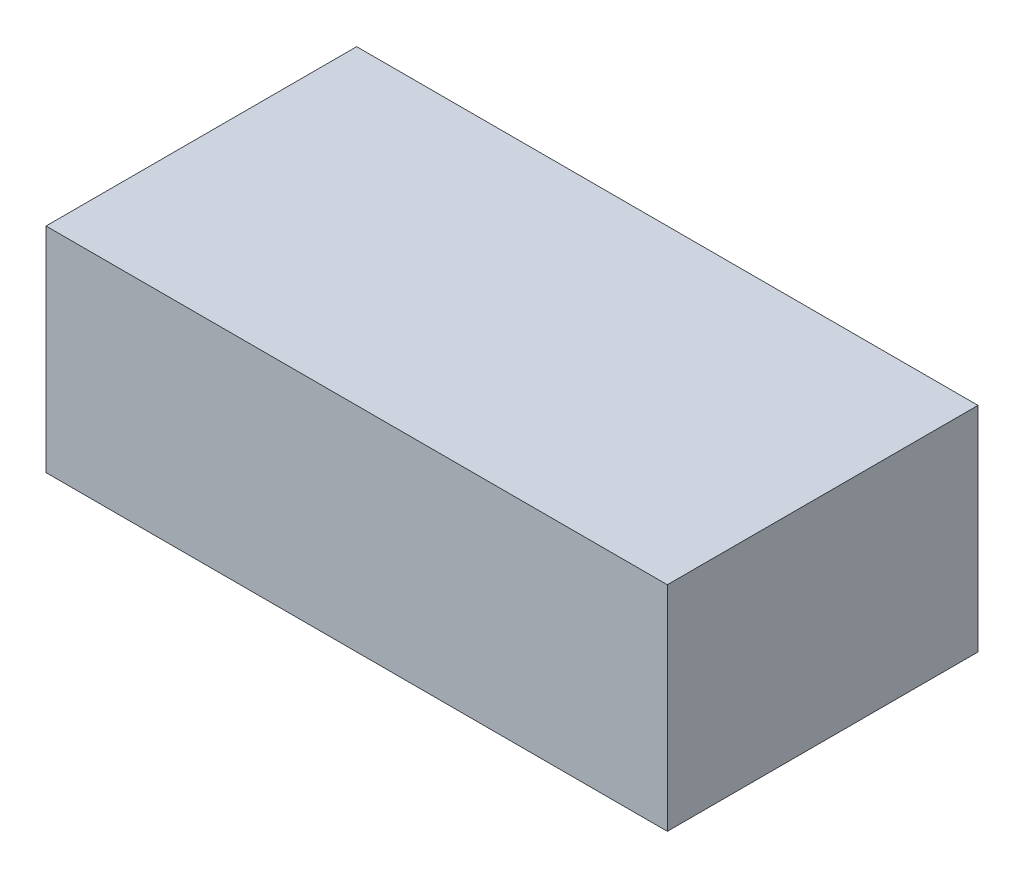
ISO-10303-21;
HEADER;
FILE_DESCRIPTION(('STEP AP214'),'2;1');
FILE_NAME('part.step','',(''),(''),'','','');
FILE_SCHEMA(('AUTOMOTIVE_DESIGN { 1 0 10303 214 1 1 1 1 }'));
ENDSEC;
DATA;
#1=APPLICATION_CONTEXT('core data for automotive mechanical design processes');
#2=APPLICATION_PROTOCOL_DEFINITION('international standard','automotive_design',2000,#1);
#3=PRODUCT_CONTEXT('',#1,'mechanical');
#4=PRODUCT('Part','Part','',(#3));
#5=PRODUCT_RELATED_PRODUCT_CATEGORY('part','',(#4));
#6=PRODUCT_DEFINITION_FORMATION('','',#4);
#7=PRODUCT_DEFINITION_CONTEXT('part definition',#1,'design');
#8=PRODUCT_DEFINITION('design','',#6,#7);
#9=PRODUCT_DEFINITION_SHAPE('','',#8);
#10=(LENGTH_UNIT() NAMED_UNIT(*) SI_UNIT(.MILLI.,.METRE.));
#11=(NAMED_UNIT(*) PLANE_ANGLE_UNIT() SI_UNIT($,.RADIAN.));
#12=(NAMED_UNIT(*) SI_UNIT($,.STERADIAN.) SOLID_ANGLE_UNIT());
#13=UNCERTAINTY_MEASURE_WITH_UNIT(LENGTH_MEASURE(1.E-05),#10,'distance_accuracy_value','');
#14=(GEOMETRIC_REPRESENTATION_CONTEXT(3) GLOBAL_UNCERTAINTY_ASSIGNED_CONTEXT((#13)) GLOBAL_UNIT_ASSIGNED_CONTEXT((#10,
#11,#12)) REPRESENTATION_CONTEXT('',''));
#15=CARTESIAN_POINT('',(0.,0.,0.));
#16=DIRECTION('',(0.,0.,1.));
#17=DIRECTION('',(1.,0.,0.));
#18=AXIS2_PLACEMENT_3D('',#15,#16,#17);
#19=CARTESIAN_POINT('',(1.6,1.1,0.8));
#20=DIRECTION('',(-1.,0.,0.));
#21=DIRECTION('',(0.,0.,1.));
#22=AXIS2_PLACEMENT_3D('',#19,#20,#21);
#23=PLANE('',#22);
#24=DIRECTION('',(0.,0.,-1.));
#25=VECTOR('',#24,1.);
#26=CARTESIAN_POINT('',(1.6,0.,0.8));
#27=LINE('',#26,#25);
#28=CARTESIAN_POINT('',(1.6,0.,0.8));
#29=VERTEX_POINT('',#28);
#30=CARTESIAN_POINT('',(1.6,0.,-0.8));
#31=VERTEX_POINT('',#30);
#32=EDGE_CURVE('E102',#29,#31,#27,.T.);
#33=ORIENTED_EDGE('',*,*,#32,.T.);
#34=DIRECTION('',(0.,-1.,0.));
#35=VECTOR('',#34,1.);
#36=CARTESIAN_POINT('',(1.6,1.1,-0.8));
#37=LINE('',#36,#35);
#38=CARTESIAN_POINT('',(1.6,1.1,-0.8));
#39=VERTEX_POINT('',#38);
#40=EDGE_CURVE('E11',#39,#31,#37,.T.);
#41=ORIENTED_EDGE('',*,*,#40,.F.);
#42=DIRECTION('',(0.,0.,-1.));
#43=VECTOR('',#42,1.);
#44=CARTESIAN_POINT('',(1.6,1.1,0.8));
#45=LINE('',#44,#43);
#46=CARTESIAN_POINT('',(1.6,1.1,0.8));
#47=VERTEX_POINT('',#46);
#48=EDGE_CURVE('E90',#47,#39,#45,.T.);
#49=ORIENTED_EDGE('',*,*,#48,.F.);
#50=DIRECTION('',(0.,-1.,0.));
#51=VECTOR('',#50,1.);
#52=CARTESIAN_POINT('',(1.6,1.1,0.8));
#53=LINE('',#52,#51);
#54=EDGE_CURVE('E98',#47,#29,#53,.T.);
#55=ORIENTED_EDGE('',*,*,#54,.T.);
#56=EDGE_LOOP('',(#33,#41,#49,#55));
#57=FACE_BOUND('',#56,.T.);
#58=ADVANCED_FACE('F39',(#57),#23,.F.);
#59=CARTESIAN_POINT('',(-1.6,1.1,-0.8));
#60=DIRECTION('',(0.,0.,1.));
#61=DIRECTION('',(1.,0.,0.));
#62=AXIS2_PLACEMENT_3D('',#59,#60,#61);
#63=PLANE('',#62);
#64=DIRECTION('',(-1.,0.,0.));
#65=VECTOR('',#64,1.);
#66=CARTESIAN_POINT('',(-1.6,0.,-0.8));
#67=LINE('',#66,#65);
#68=CARTESIAN_POINT('',(-1.6,0.,-0.8));
#69=VERTEX_POINT('',#68);
#70=EDGE_CURVE('E94',#31,#69,#67,.T.);
#71=ORIENTED_EDGE('',*,*,#70,.T.);
#72=DIRECTION('',(0.,-1.,0.));
#73=VECTOR('',#72,1.);
#74=CARTESIAN_POINT('',(-1.6,1.1,-0.8));
#75=LINE('',#74,#73);
#76=CARTESIAN_POINT('',(-1.6,1.1,-0.8));
#77=VERTEX_POINT('',#76);
#78=EDGE_CURVE('E47',#77,#69,#75,.T.);
#79=ORIENTED_EDGE('',*,*,#78,.F.);
#80=DIRECTION('',(-1.,0.,0.));
#81=VECTOR('',#80,1.);
#82=CARTESIAN_POINT('',(-1.6,1.1,-0.8));
#83=LINE('',#82,#81);
#84=EDGE_CURVE('E85',#39,#77,#83,.T.);
#85=ORIENTED_EDGE('',*,*,#84,.F.);
#86=ORIENTED_EDGE('',*,*,#40,.T.);
#87=EDGE_LOOP('',(#71,#79,#85,#86));
#88=FACE_BOUND('',#87,.T.);
#89=ADVANCED_FACE('F93',(#88),#63,.F.);
#90=CARTESIAN_POINT('',(-1.6,1.1,0.8));
#91=DIRECTION('',(1.,0.,0.));
#92=DIRECTION('',(0.,0.,-1.));
#93=AXIS2_PLACEMENT_3D('',#90,#91,#92);
#94=PLANE('',#93);
#95=DIRECTION('',(0.,0.,1.));
#96=VECTOR('',#95,1.);
#97=CARTESIAN_POINT('',(-1.6,0.,0.8));
#98=LINE('',#97,#96);
#99=CARTESIAN_POINT('',(-1.6,0.,0.8));
#100=VERTEX_POINT('',#99);
#101=EDGE_CURVE('E72',#69,#100,#98,.T.);
#102=ORIENTED_EDGE('',*,*,#101,.T.);
#103=DIRECTION('',(0.,-1.,0.));
#104=VECTOR('',#103,1.);
#105=CARTESIAN_POINT('',(-1.6,1.1,0.8));
#106=LINE('',#105,#104);
#107=CARTESIAN_POINT('',(-1.6,1.1,0.8));
#108=VERTEX_POINT('',#107);
#109=EDGE_CURVE('E95',#108,#100,#106,.T.);
#110=ORIENTED_EDGE('',*,*,#109,.F.);
#111=DIRECTION('',(0.,0.,1.));
#112=VECTOR('',#111,1.);
#113=CARTESIAN_POINT('',(-1.6,1.1,0.8));
#114=LINE('',#113,#112);
#115=EDGE_CURVE('E88',#77,#108,#114,.T.);
#116=ORIENTED_EDGE('',*,*,#115,.F.);
#117=ORIENTED_EDGE('',*,*,#78,.T.);
#118=EDGE_LOOP('',(#102,#110,#116,#117));
#119=FACE_BOUND('',#118,.T.);
#120=ADVANCED_FACE('F96',(#119),#94,.F.);
#121=CARTESIAN_POINT('',(-1.6,1.1,0.8));
#122=DIRECTION('',(0.,0.,-1.));
#123=DIRECTION('',(-1.,0.,0.));
#124=AXIS2_PLACEMENT_3D('',#121,#122,#123);
#125=PLANE('',#124);
#126=DIRECTION('',(1.,0.,0.));
#127=VECTOR('',#126,1.);
#128=CARTESIAN_POINT('',(-1.6,0.,0.8));
#129=LINE('',#128,#127);
#130=EDGE_CURVE('E78',#100,#29,#129,.T.);
#131=ORIENTED_EDGE('',*,*,#130,.T.);
#132=ORIENTED_EDGE('',*,*,#54,.F.);
#133=DIRECTION('',(1.,0.,0.));
#134=VECTOR('',#133,1.);
#135=CARTESIAN_POINT('',(-1.6,1.1,0.8));
#136=LINE('',#135,#134);
#137=EDGE_CURVE('E55',#108,#47,#136,.T.);
#138=ORIENTED_EDGE('',*,*,#137,.F.);
#139=ORIENTED_EDGE('',*,*,#109,.T.);
#140=EDGE_LOOP('',(#131,#132,#138,#139));
#141=FACE_BOUND('',#140,.T.);
#142=ADVANCED_FACE('F109',(#141),#125,.F.);
#143=CARTESIAN_POINT('',(0.,1.1,0.));
#144=DIRECTION('',(0.,-1.,0.));
#145=DIRECTION('',(0.,0.,-1.));
#146=AXIS2_PLACEMENT_3D('',#143,#144,#145);
#147=PLANE('',#146);
#148=ORIENTED_EDGE('',*,*,#48,.T.);
#149=ORIENTED_EDGE('',*,*,#84,.T.);
#150=ORIENTED_EDGE('',*,*,#115,.T.);
#151=ORIENTED_EDGE('',*,*,#137,.T.);
#152=EDGE_LOOP('',(#148,#149,#150,#151));
#153=FACE_BOUND('',#152,.T.);
#154=ADVANCED_FACE('F86',(#153),#147,.F.);
#155=CARTESIAN_POINT('',(0.,0.,0.));
#156=DIRECTION('',(0.,-1.,0.));
#157=DIRECTION('',(0.,0.,-1.));
#158=AXIS2_PLACEMENT_3D('',#155,#156,#157);
#159=PLANE('',#158);
#160=ORIENTED_EDGE('',*,*,#32,.F.);
#161=ORIENTED_EDGE('',*,*,#130,.F.);
#162=ORIENTED_EDGE('',*,*,#101,.F.);
#163=ORIENTED_EDGE('',*,*,#70,.F.);
#164=EDGE_LOOP('',(#160,#161,#162,#163));
#165=FACE_BOUND('',#164,.T.);
#166=ADVANCED_FACE('F112',(#165),#159,.T.);
#167=CLOSED_SHELL('',(#58,#89,#120,#142,#154,#166));
#168=MANIFOLD_SOLID_BREP('B2',#167);
#169=ADVANCED_BREP_SHAPE_REPRESENTATION('',(#18,#168),#14);
#170=SHAPE_DEFINITION_REPRESENTATION(#9,#169);
ENDSEC;
END-ISO-10303-21;
